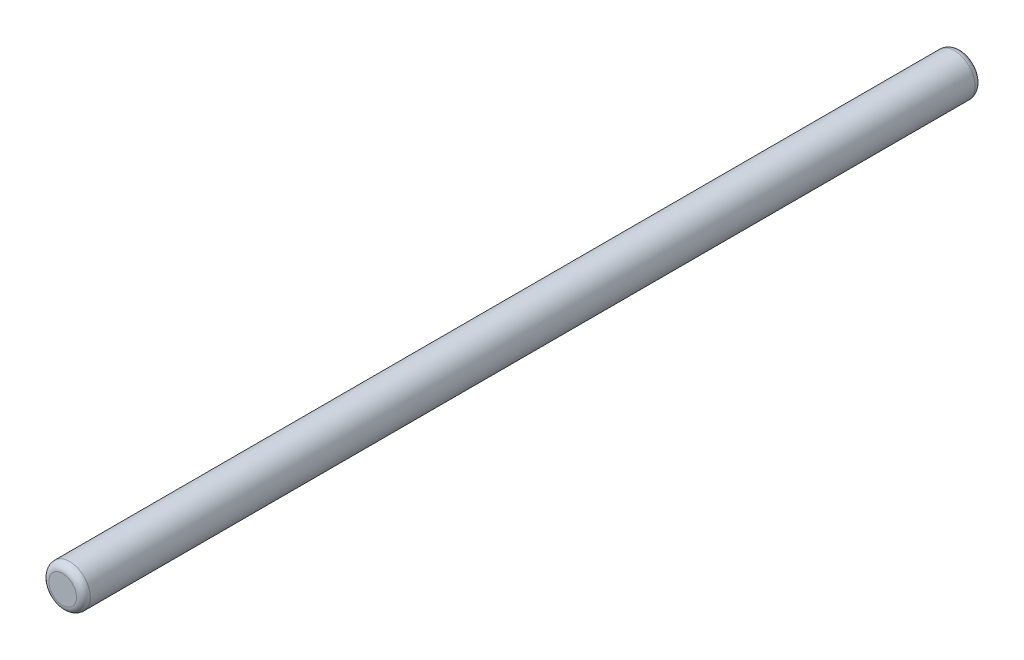
ISO-10303-21;
HEADER;
FILE_DESCRIPTION(('STEP AP214'),'2;1');
FILE_NAME('part.step','',(''),(''),'','','');
FILE_SCHEMA(('AUTOMOTIVE_DESIGN { 1 0 10303 214 1 1 1 1 }'));
ENDSEC;
DATA;
#1=APPLICATION_CONTEXT('core data for automotive mechanical design processes');
#2=APPLICATION_PROTOCOL_DEFINITION('international standard','automotive_design',2000,#1);
#3=PRODUCT_CONTEXT('',#1,'mechanical');
#4=PRODUCT('Part','Part','',(#3));
#5=PRODUCT_RELATED_PRODUCT_CATEGORY('part','',(#4));
#6=PRODUCT_DEFINITION_FORMATION('','',#4);
#7=PRODUCT_DEFINITION_CONTEXT('part definition',#1,'design');
#8=PRODUCT_DEFINITION('design','',#6,#7);
#9=PRODUCT_DEFINITION_SHAPE('','',#8);
#10=(LENGTH_UNIT() NAMED_UNIT(*) SI_UNIT(.MILLI.,.METRE.));
#11=(NAMED_UNIT(*) PLANE_ANGLE_UNIT() SI_UNIT($,.RADIAN.));
#12=(NAMED_UNIT(*) SI_UNIT($,.STERADIAN.) SOLID_ANGLE_UNIT());
#13=UNCERTAINTY_MEASURE_WITH_UNIT(LENGTH_MEASURE(1.E-05),#10,'distance_accuracy_value','');
#14=(GEOMETRIC_REPRESENTATION_CONTEXT(3) GLOBAL_UNCERTAINTY_ASSIGNED_CONTEXT((#13)) GLOBAL_UNIT_ASSIGNED_CONTEXT((#10,
#11,#12)) REPRESENTATION_CONTEXT('',''));
#15=CARTESIAN_POINT('',(0.,0.,0.));
#16=DIRECTION('',(0.,0.,1.));
#17=DIRECTION('',(1.,0.,0.));
#18=AXIS2_PLACEMENT_3D('',#15,#16,#17);
#19=CARTESIAN_POINT('',(0.,0.,65.));
#20=DIRECTION('',(0.,0.,-1.));
#21=DIRECTION('',(-1.,0.,0.));
#22=AXIS2_PLACEMENT_3D('',#19,#20,#21);
#23=CYLINDRICAL_SURFACE('',#22,1.5);
#24=CARTESIAN_POINT('',(0.,0.,0.5));
#25=DIRECTION('',(0.,0.,1.));
#26=DIRECTION('',(1.,0.,0.));
#27=AXIS2_PLACEMENT_3D('',#24,#25,#26);
#28=CIRCLE('',#27,1.5);
#29=CARTESIAN_POINT('',(1.5,0.,0.5));
#30=VERTEX_POINT('',#29);
#31=EDGE_CURVE('E41',#30,#30,#28,.T.);
#32=ORIENTED_EDGE('',*,*,#31,.T.);
#33=EDGE_LOOP('',(#32));
#34=FACE_BOUND('',#33,.T.);
#35=CARTESIAN_POINT('',(0.,0.,64.5));
#36=DIRECTION('',(0.,0.,1.));
#37=DIRECTION('',(1.,0.,0.));
#38=AXIS2_PLACEMENT_3D('',#35,#36,#37);
#39=CIRCLE('',#38,1.5);
#40=CARTESIAN_POINT('',(1.5,0.,64.5));
#41=VERTEX_POINT('',#40);
#42=EDGE_CURVE('E45',#41,#41,#39,.F.);
#43=ORIENTED_EDGE('',*,*,#42,.T.);
#44=EDGE_LOOP('',(#43));
#45=FACE_BOUND('',#44,.T.);
#46=ADVANCED_FACE('F30',(#34,#45),#23,.T.);
#47=CARTESIAN_POINT('',(0.,0.,65.));
#48=DIRECTION('',(0.,0.,1.));
#49=DIRECTION('',(1.,0.,0.));
#50=AXIS2_PLACEMENT_3D('',#47,#48,#49);
#51=PLANE('',#50);
#52=CARTESIAN_POINT('',(0.,0.,65.));
#53=DIRECTION('',(0.,0.,1.));
#54=DIRECTION('',(1.,0.,0.));
#55=AXIS2_PLACEMENT_3D('',#52,#53,#54);
#56=CIRCLE('',#55,1.);
#57=CARTESIAN_POINT('',(1.,0.,65.));
#58=VERTEX_POINT('',#57);
#59=EDGE_CURVE('E10',#58,#58,#56,.T.);
#60=ORIENTED_EDGE('',*,*,#59,.T.);
#61=EDGE_LOOP('',(#60));
#62=FACE_BOUND('',#61,.T.);
#63=ADVANCED_FACE('F61',(#62),#51,.T.);
#64=CARTESIAN_POINT('',(0.,0.,0.));
#65=DIRECTION('',(0.,0.,1.));
#66=DIRECTION('',(1.,0.,0.));
#67=AXIS2_PLACEMENT_3D('',#64,#65,#66);
#68=PLANE('',#67);
#69=CARTESIAN_POINT('',(0.,0.,0.));
#70=DIRECTION('',(0.,0.,1.));
#71=DIRECTION('',(1.,0.,0.));
#72=AXIS2_PLACEMENT_3D('',#69,#70,#71);
#73=CIRCLE('',#72,1.);
#74=CARTESIAN_POINT('',(1.,0.,0.));
#75=VERTEX_POINT('',#74);
#76=EDGE_CURVE('E37',#75,#75,#73,.F.);
#77=ORIENTED_EDGE('',*,*,#76,.T.);
#78=EDGE_LOOP('',(#77));
#79=FACE_BOUND('',#78,.T.);
#80=ADVANCED_FACE('F58',(#79),#68,.F.);
#81=CARTESIAN_POINT('',(0.,0.,0.5));
#82=DIRECTION('',(0.,0.,1.));
#83=DIRECTION('',(1.,0.,0.));
#84=AXIS2_PLACEMENT_3D('',#81,#82,#83);
#85=TOROIDAL_SURFACE('',#84,1.,0.5);
#86=ORIENTED_EDGE('',*,*,#76,.F.);
#87=EDGE_LOOP('',(#86));
#88=FACE_BOUND('',#87,.T.);
#89=ORIENTED_EDGE('',*,*,#31,.F.);
#90=EDGE_LOOP('',(#89));
#91=FACE_BOUND('',#90,.T.);
#92=ADVANCED_FACE('F54',(#88,#91),#85,.T.);
#93=CARTESIAN_POINT('',(0.,0.,64.5));
#94=DIRECTION('',(0.,0.,1.));
#95=DIRECTION('',(1.,0.,0.));
#96=AXIS2_PLACEMENT_3D('',#93,#94,#95);
#97=TOROIDAL_SURFACE('',#96,1.,0.5);
#98=ORIENTED_EDGE('',*,*,#42,.F.);
#99=EDGE_LOOP('',(#98));
#100=FACE_BOUND('',#99,.T.);
#101=ORIENTED_EDGE('',*,*,#59,.F.);
#102=EDGE_LOOP('',(#101));
#103=FACE_BOUND('',#102,.T.);
#104=ADVANCED_FACE('F32',(#100,#103),#97,.T.);
#105=CLOSED_SHELL('',(#46,#63,#80,#92,#104));
#106=MANIFOLD_SOLID_BREP('B2',#105);
#107=ADVANCED_BREP_SHAPE_REPRESENTATION('',(#18,#106),#14);
#108=SHAPE_DEFINITION_REPRESENTATION(#9,#107);
ENDSEC;
END-ISO-10303-21;
